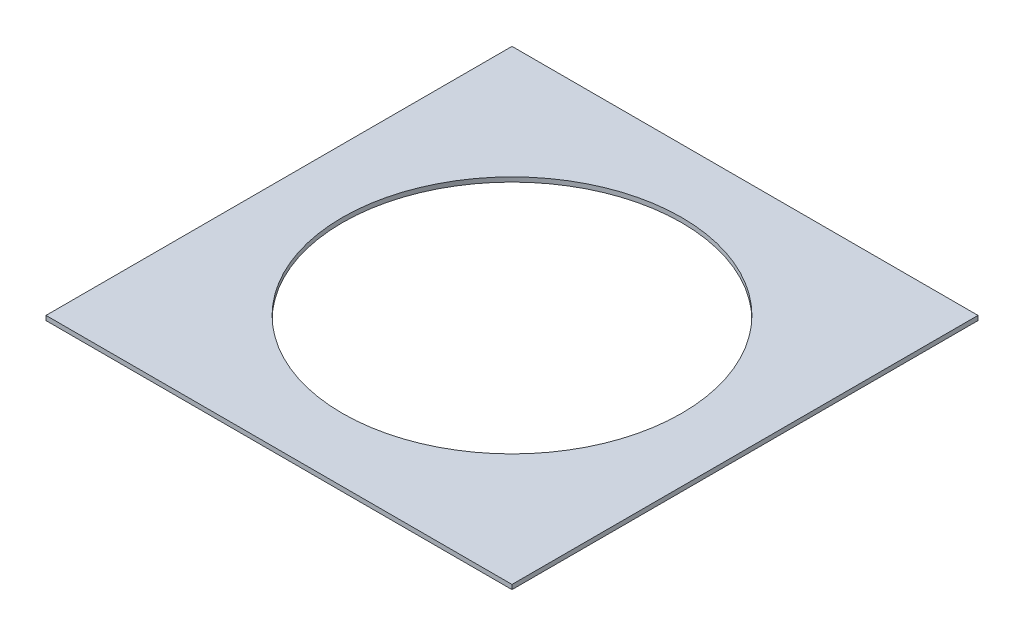
ISO-10303-21;
HEADER;
FILE_DESCRIPTION(('STEP AP214'),'2;1');
FILE_NAME('part.step','',(''),(''),'','','');
FILE_SCHEMA(('AUTOMOTIVE_DESIGN { 1 0 10303 214 1 1 1 1 }'));
ENDSEC;
DATA;
#1=APPLICATION_CONTEXT('core data for automotive mechanical design processes');
#2=APPLICATION_PROTOCOL_DEFINITION('international standard','automotive_design',2000,#1);
#3=PRODUCT_CONTEXT('',#1,'mechanical');
#4=PRODUCT('Part','Part','',(#3));
#5=PRODUCT_RELATED_PRODUCT_CATEGORY('part','',(#4));
#6=PRODUCT_DEFINITION_FORMATION('','',#4);
#7=PRODUCT_DEFINITION_CONTEXT('part definition',#1,'design');
#8=PRODUCT_DEFINITION('design','',#6,#7);
#9=PRODUCT_DEFINITION_SHAPE('','',#8);
#10=(LENGTH_UNIT() NAMED_UNIT(*) SI_UNIT(.MILLI.,.METRE.));
#11=(NAMED_UNIT(*) PLANE_ANGLE_UNIT() SI_UNIT($,.RADIAN.));
#12=(NAMED_UNIT(*) SI_UNIT($,.STERADIAN.) SOLID_ANGLE_UNIT());
#13=UNCERTAINTY_MEASURE_WITH_UNIT(LENGTH_MEASURE(1.E-05),#10,'distance_accuracy_value','');
#14=(GEOMETRIC_REPRESENTATION_CONTEXT(3) GLOBAL_UNCERTAINTY_ASSIGNED_CONTEXT((#13)) GLOBAL_UNIT_ASSIGNED_CONTEXT((#10,
#11,#12)) REPRESENTATION_CONTEXT('',''));
#15=CARTESIAN_POINT('',(0.,0.,0.));
#16=DIRECTION('',(0.,0.,1.));
#17=DIRECTION('',(1.,0.,0.));
#18=AXIS2_PLACEMENT_3D('',#15,#16,#17);
#19=CARTESIAN_POINT('',(0.,2.,0.));
#20=DIRECTION('',(0.,1.,0.));
#21=DIRECTION('',(0.,0.,1.));
#22=AXIS2_PLACEMENT_3D('',#19,#20,#21);
#23=PLANE('',#22);
#24=DIRECTION('',(0.,0.,-1.));
#25=VECTOR('',#24,1.);
#26=CARTESIAN_POINT('',(103.,2.,-103.));
#27=LINE('',#26,#25);
#28=CARTESIAN_POINT('',(103.,2.,103.));
#29=VERTEX_POINT('',#28);
#30=CARTESIAN_POINT('',(103.,2.,-103.));
#31=VERTEX_POINT('',#30);
#32=EDGE_CURVE('E96',#29,#31,#27,.T.);
#33=ORIENTED_EDGE('',*,*,#32,.T.);
#34=DIRECTION('',(-1.,0.,0.));
#35=VECTOR('',#34,1.);
#36=CARTESIAN_POINT('',(-103.,2.,-103.));
#37=LINE('',#36,#35);
#38=CARTESIAN_POINT('',(-103.,2.,-103.));
#39=VERTEX_POINT('',#38);
#40=EDGE_CURVE('E91',#31,#39,#37,.T.);
#41=ORIENTED_EDGE('',*,*,#40,.T.);
#42=DIRECTION('',(0.,0.,1.));
#43=VECTOR('',#42,1.);
#44=CARTESIAN_POINT('',(-103.,2.,-103.));
#45=LINE('',#44,#43);
#46=CARTESIAN_POINT('',(-103.,2.,103.));
#47=VERTEX_POINT('',#46);
#48=EDGE_CURVE('E94',#39,#47,#45,.T.);
#49=ORIENTED_EDGE('',*,*,#48,.T.);
#50=DIRECTION('',(1.,0.,0.));
#51=VECTOR('',#50,1.);
#52=CARTESIAN_POINT('',(-103.,2.,103.));
#53=LINE('',#52,#51);
#54=EDGE_CURVE('E61',#47,#29,#53,.T.);
#55=ORIENTED_EDGE('',*,*,#54,.T.);
#56=EDGE_LOOP('',(#33,#41,#49,#55));
#57=FACE_BOUND('',#56,.T.);
#58=CARTESIAN_POINT('',(0.,2.,0.));
#59=DIRECTION('',(0.,1.,0.));
#60=DIRECTION('',(0.,0.,1.));
#61=AXIS2_PLACEMENT_3D('',#58,#59,#60);
#62=CIRCLE('',#61,75.);
#63=CARTESIAN_POINT('',(0.,2.,75.));
#64=VERTEX_POINT('',#63);
#65=EDGE_CURVE('E116',#64,#64,#62,.T.);
#66=ORIENTED_EDGE('',*,*,#65,.F.);
#67=EDGE_LOOP('',(#66));
#68=FACE_BOUND('',#67,.T.);
#69=ADVANCED_FACE('F43',(#57,#68),#23,.T.);
#70=CARTESIAN_POINT('',(0.,0.,0.));
#71=DIRECTION('',(0.,1.,0.));
#72=DIRECTION('',(0.,0.,1.));
#73=AXIS2_PLACEMENT_3D('',#70,#71,#72);
#74=PLANE('',#73);
#75=DIRECTION('',(0.,0.,-1.));
#76=VECTOR('',#75,1.);
#77=CARTESIAN_POINT('',(103.,0.,-103.));
#78=LINE('',#77,#76);
#79=CARTESIAN_POINT('',(103.,0.,103.));
#80=VERTEX_POINT('',#79);
#81=CARTESIAN_POINT('',(103.,0.,-103.));
#82=VERTEX_POINT('',#81);
#83=EDGE_CURVE('E112',#80,#82,#78,.T.);
#84=ORIENTED_EDGE('',*,*,#83,.F.);
#85=DIRECTION('',(1.,0.,0.));
#86=VECTOR('',#85,1.);
#87=CARTESIAN_POINT('',(-103.,0.,103.));
#88=LINE('',#87,#86);
#89=CARTESIAN_POINT('',(-103.,0.,103.));
#90=VERTEX_POINT('',#89);
#91=EDGE_CURVE('E84',#90,#80,#88,.T.);
#92=ORIENTED_EDGE('',*,*,#91,.F.);
#93=DIRECTION('',(0.,0.,1.));
#94=VECTOR('',#93,1.);
#95=CARTESIAN_POINT('',(-103.,0.,-103.));
#96=LINE('',#95,#94);
#97=CARTESIAN_POINT('',(-103.,0.,-103.));
#98=VERTEX_POINT('',#97);
#99=EDGE_CURVE('E78',#98,#90,#96,.T.);
#100=ORIENTED_EDGE('',*,*,#99,.F.);
#101=DIRECTION('',(-1.,0.,0.));
#102=VECTOR('',#101,1.);
#103=CARTESIAN_POINT('',(-103.,0.,-103.));
#104=LINE('',#103,#102);
#105=EDGE_CURVE('E101',#82,#98,#104,.T.);
#106=ORIENTED_EDGE('',*,*,#105,.F.);
#107=EDGE_LOOP('',(#84,#92,#100,#106));
#108=FACE_BOUND('',#107,.T.);
#109=CARTESIAN_POINT('',(0.,0.,0.));
#110=DIRECTION('',(0.,1.,0.));
#111=DIRECTION('',(0.,0.,1.));
#112=AXIS2_PLACEMENT_3D('',#109,#110,#111);
#113=CIRCLE('',#112,75.);
#114=CARTESIAN_POINT('',(0.,0.,75.));
#115=VERTEX_POINT('',#114);
#116=EDGE_CURVE('E134',#115,#115,#113,.T.);
#117=ORIENTED_EDGE('',*,*,#116,.T.);
#118=EDGE_LOOP('',(#117));
#119=FACE_BOUND('',#118,.T.);
#120=ADVANCED_FACE('F129',(#108,#119),#74,.F.);
#121=CARTESIAN_POINT('',(103.,2.,-103.));
#122=DIRECTION('',(-1.,0.,0.));
#123=DIRECTION('',(0.,0.,1.));
#124=AXIS2_PLACEMENT_3D('',#121,#122,#123);
#125=PLANE('',#124);
#126=ORIENTED_EDGE('',*,*,#83,.T.);
#127=DIRECTION('',(0.,-1.,0.));
#128=VECTOR('',#127,1.);
#129=CARTESIAN_POINT('',(103.,2.,-103.));
#130=LINE('',#129,#128);
#131=EDGE_CURVE('E11',#31,#82,#130,.T.);
#132=ORIENTED_EDGE('',*,*,#131,.F.);
#133=ORIENTED_EDGE('',*,*,#32,.F.);
#134=DIRECTION('',(0.,-1.,0.));
#135=VECTOR('',#134,1.);
#136=CARTESIAN_POINT('',(103.,2.,103.));
#137=LINE('',#136,#135);
#138=EDGE_CURVE('E108',#29,#80,#137,.T.);
#139=ORIENTED_EDGE('',*,*,#138,.T.);
#140=EDGE_LOOP('',(#126,#132,#133,#139));
#141=FACE_BOUND('',#140,.T.);
#142=ADVANCED_FACE('F45',(#141),#125,.F.);
#143=CARTESIAN_POINT('',(-103.,2.,-103.));
#144=DIRECTION('',(0.,0.,1.));
#145=DIRECTION('',(1.,0.,0.));
#146=AXIS2_PLACEMENT_3D('',#143,#144,#145);
#147=PLANE('',#146);
#148=ORIENTED_EDGE('',*,*,#105,.T.);
#149=DIRECTION('',(0.,-1.,0.));
#150=VECTOR('',#149,1.);
#151=CARTESIAN_POINT('',(-103.,2.,-103.));
#152=LINE('',#151,#150);
#153=EDGE_CURVE('E53',#39,#98,#152,.T.);
#154=ORIENTED_EDGE('',*,*,#153,.F.);
#155=ORIENTED_EDGE('',*,*,#40,.F.);
#156=ORIENTED_EDGE('',*,*,#131,.T.);
#157=EDGE_LOOP('',(#148,#154,#155,#156));
#158=FACE_BOUND('',#157,.T.);
#159=ADVANCED_FACE('F100',(#158),#147,.F.);
#160=CARTESIAN_POINT('',(-103.,2.,-103.));
#161=DIRECTION('',(1.,0.,0.));
#162=DIRECTION('',(0.,0.,-1.));
#163=AXIS2_PLACEMENT_3D('',#160,#161,#162);
#164=PLANE('',#163);
#165=ORIENTED_EDGE('',*,*,#99,.T.);
#166=DIRECTION('',(0.,-1.,0.));
#167=VECTOR('',#166,1.);
#168=CARTESIAN_POINT('',(-103.,2.,103.));
#169=LINE('',#168,#167);
#170=EDGE_CURVE('E103',#47,#90,#169,.T.);
#171=ORIENTED_EDGE('',*,*,#170,.F.);
#172=ORIENTED_EDGE('',*,*,#48,.F.);
#173=ORIENTED_EDGE('',*,*,#153,.T.);
#174=EDGE_LOOP('',(#165,#171,#172,#173));
#175=FACE_BOUND('',#174,.T.);
#176=ADVANCED_FACE('F104',(#175),#164,.F.);
#177=CARTESIAN_POINT('',(-103.,2.,103.));
#178=DIRECTION('',(0.,0.,-1.));
#179=DIRECTION('',(-1.,0.,0.));
#180=AXIS2_PLACEMENT_3D('',#177,#178,#179);
#181=PLANE('',#180);
#182=ORIENTED_EDGE('',*,*,#91,.T.);
#183=ORIENTED_EDGE('',*,*,#138,.F.);
#184=ORIENTED_EDGE('',*,*,#54,.F.);
#185=ORIENTED_EDGE('',*,*,#170,.T.);
#186=EDGE_LOOP('',(#182,#183,#184,#185));
#187=FACE_BOUND('',#186,.T.);
#188=ADVANCED_FACE('F126',(#187),#181,.F.);
#189=CARTESIAN_POINT('',(0.,2.,0.));
#190=DIRECTION('',(0.,-1.,0.));
#191=DIRECTION('',(0.,0.,-1.));
#192=AXIS2_PLACEMENT_3D('',#189,#190,#191);
#193=CYLINDRICAL_SURFACE('',#192,75.);
#194=ORIENTED_EDGE('',*,*,#65,.T.);
#195=EDGE_LOOP('',(#194));
#196=FACE_BOUND('',#195,.T.);
#197=ORIENTED_EDGE('',*,*,#116,.F.);
#198=EDGE_LOOP('',(#197));
#199=FACE_BOUND('',#198,.T.);
#200=ADVANCED_FACE('F142',(#196,#199),#193,.F.);
#201=CLOSED_SHELL('',(#69,#120,#142,#159,#176,#188,#200));
#202=MANIFOLD_SOLID_BREP('B2',#201);
#203=ADVANCED_BREP_SHAPE_REPRESENTATION('',(#18,#202),#14);
#204=SHAPE_DEFINITION_REPRESENTATION(#9,#203);
ENDSEC;
END-ISO-10303-21;
